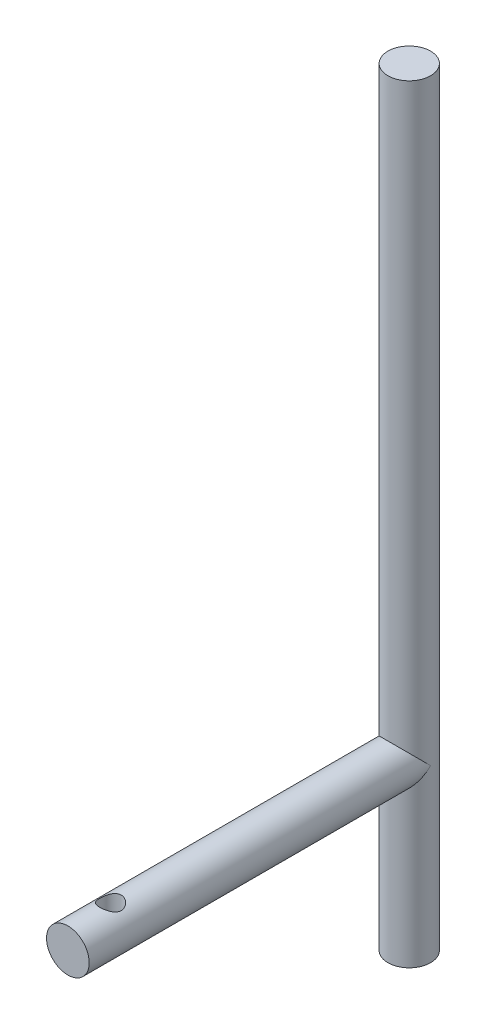
ISO-10303-21;
HEADER;
FILE_DESCRIPTION(('STEP AP214'),'2;1');
FILE_NAME('part.step','',(''),(''),'','','');
FILE_SCHEMA(('AUTOMOTIVE_DESIGN { 1 0 10303 214 1 1 1 1 }'));
ENDSEC;
DATA;
#1=APPLICATION_CONTEXT('core data for automotive mechanical design processes');
#2=APPLICATION_PROTOCOL_DEFINITION('international standard','automotive_design',2000,#1);
#3=PRODUCT_CONTEXT('',#1,'mechanical');
#4=PRODUCT('Part','Part','',(#3));
#5=PRODUCT_RELATED_PRODUCT_CATEGORY('part','',(#4));
#6=PRODUCT_DEFINITION_FORMATION('','',#4);
#7=PRODUCT_DEFINITION_CONTEXT('part definition',#1,'design');
#8=PRODUCT_DEFINITION('design','',#6,#7);
#9=PRODUCT_DEFINITION_SHAPE('','',#8);
#10=(LENGTH_UNIT() NAMED_UNIT(*) SI_UNIT(.MILLI.,.METRE.));
#11=(NAMED_UNIT(*) PLANE_ANGLE_UNIT() SI_UNIT($,.RADIAN.));
#12=(NAMED_UNIT(*) SI_UNIT($,.STERADIAN.) SOLID_ANGLE_UNIT());
#13=UNCERTAINTY_MEASURE_WITH_UNIT(LENGTH_MEASURE(1.E-05),#10,'distance_accuracy_value','');
#14=(GEOMETRIC_REPRESENTATION_CONTEXT(3) GLOBAL_UNCERTAINTY_ASSIGNED_CONTEXT((#13)) GLOBAL_UNIT_ASSIGNED_CONTEXT((#10,
#11,#12)) REPRESENTATION_CONTEXT('',''));
#15=CARTESIAN_POINT('',(0.,0.,0.));
#16=DIRECTION('',(0.,0.,1.));
#17=DIRECTION('',(1.,0.,0.));
#18=AXIS2_PLACEMENT_3D('',#15,#16,#17);
#19=CARTESIAN_POINT('',(0.,25.4,50.8));
#20=DIRECTION('',(0.,0.,-1.));
#21=DIRECTION('',(-1.,0.,0.));
#22=AXIS2_PLACEMENT_3D('',#19,#20,#21);
#23=CYLINDRICAL_SURFACE('',#22,3.175);
#24=CARTESIAN_POINT('',(0.,25.4,50.8));
#25=DIRECTION('',(0.,0.,1.));
#26=DIRECTION('',(1.,0.,0.));
#27=AXIS2_PLACEMENT_3D('',#24,#25,#26);
#28=CIRCLE('',#27,3.175);
#29=CARTESIAN_POINT('',(3.175,25.4,50.8));
#30=VERTEX_POINT('',#29);
#31=EDGE_CURVE('E94',#30,#30,#28,.T.);
#32=ORIENTED_EDGE('',*,*,#31,.F.);
#33=EDGE_LOOP('',(#32));
#34=FACE_BOUND('',#33,.T.);
#35=CARTESIAN_POINT('',(0.,25.4,0.));
#36=DIRECTION('',(0.,-0.707106781186547,0.707106781186547));
#37=DIRECTION('',(0.,-0.707106781186547,-0.707106781186547));
#38=AXIS2_PLACEMENT_3D('',#35,#36,#37);
#39=ELLIPSE('',#38,4.49012806053458,3.175);
#40=CARTESIAN_POINT('',(3.175,25.4,0.));
#41=VERTEX_POINT('',#40);
#42=CARTESIAN_POINT('',(-3.175,25.4,0.));
#43=VERTEX_POINT('',#42);
#44=EDGE_CURVE('E49',#41,#43,#39,.T.);
#45=ORIENTED_EDGE('',*,*,#44,.T.);
#46=CARTESIAN_POINT('',(0.,25.4,0.));
#47=DIRECTION('',(0.,-0.707106781186547,-0.707106781186547));
#48=DIRECTION('',(0.,-0.707106781186547,0.707106781186547));
#49=AXIS2_PLACEMENT_3D('',#46,#47,#48);
#50=ELLIPSE('',#49,4.49012806053458,3.175);
#51=EDGE_CURVE('E11',#43,#41,#50,.F.);
#52=ORIENTED_EDGE('',*,*,#51,.T.);
#53=EDGE_LOOP('',(#45,#52));
#54=FACE_BOUND('',#53,.T.);
#55=CARTESIAN_POINT('',(0.,22.225,42.8625));
#56=CARTESIAN_POINT('',(0.0834579911850827,22.225004549695,42.8625052424285));
#57=CARTESIAN_POINT('',(0.16701547701988,22.2283259550614,42.8691199910797));
#58=CARTESIAN_POINT('',(0.331660873489372,22.2412852729101,42.8952864475422));
#59=CARTESIAN_POINT('',(0.412743787657886,22.2509351807159,42.914862723884));
#60=CARTESIAN_POINT('',(0.569807002497712,22.2755415644714,42.9659951711789));
#61=CARTESIAN_POINT('',(0.645805799665895,22.2904774030566,42.9975047849936));
#62=CARTESIAN_POINT('',(0.791325279180476,22.3242857978123,43.0713683614169));
#63=CARTESIAN_POINT('',(0.860846471709219,22.3431580435678,43.1137214689951));
#64=CARTESIAN_POINT('',(0.996168660697031,22.3844444001533,43.2109836335579));
#65=CARTESIAN_POINT('',(1.06149014765635,22.4070037138503,43.2664972857929));
#66=CARTESIAN_POINT('',(1.18233736872633,22.452647972333,43.3872028483047));
#67=CARTESIAN_POINT('',(1.23785563818199,22.4757333026816,43.4524020646888));
#68=CARTESIAN_POINT('',(1.34183755071482,22.5218791497421,43.5966923173684));
#69=CARTESIAN_POINT('',(1.38942022018822,22.5447989068492,43.6764685561241));
#70=CARTESIAN_POINT('',(1.47029206018898,22.5855850869894,43.8441581458781));
#71=CARTESIAN_POINT('',(1.50359144125905,22.603455116739,43.9320656293474));
#72=CARTESIAN_POINT('',(1.55278525197438,22.6304813607748,44.1081558548573));
#73=CARTESIAN_POINT('',(1.5696022981152,22.6400951886085,44.196007067657));
#74=CARTESIAN_POINT('',(1.58817785187779,22.6507374970671,44.3737664049749));
#75=CARTESIAN_POINT('',(1.58995124029225,22.6517744616753,44.463672408633));
#76=CARTESIAN_POINT('',(1.57906606838602,22.6455139821662,44.6314290636006));
#77=CARTESIAN_POINT('',(1.5681079882647,22.6391983768655,44.7094356495666));
#78=CARTESIAN_POINT('',(1.53501701037788,22.6206648688501,44.8623085311297));
#79=CARTESIAN_POINT('',(1.51288055293752,22.6084450860455,44.9371738181722));
#80=CARTESIAN_POINT('',(1.45765802636278,22.5792113119477,45.083776247948));
#81=CARTESIAN_POINT('',(1.42432891904664,22.562092279459,45.1553999080724));
#82=CARTESIAN_POINT('',(1.34785367917295,22.5249834570327,45.2923819394866));
#83=CARTESIAN_POINT('',(1.30470313705229,22.5049923791145,45.3577374777651));
#84=CARTESIAN_POINT('',(1.20342986217405,22.4613286182853,45.4890524887299));
#85=CARTESIAN_POINT('',(1.14410245266123,22.4375105249917,45.5540377868021));
#86=CARTESIAN_POINT('',(1.01529448125193,22.390931480106,45.6735424770131));
#87=CARTESIAN_POINT('',(0.945809094811679,22.368171037654,45.7280568673538));
#88=CARTESIAN_POINT('',(0.794569953008062,22.3249809518829,45.8274509868847));
#89=CARTESIAN_POINT('',(0.712396326664065,22.3047086264281,45.8717657500076));
#90=CARTESIAN_POINT('',(0.540490117088468,22.2701186372003,45.9455790336058));
#91=CARTESIAN_POINT('',(0.450763602321128,22.2557962467711,45.9750893187116));
#92=CARTESIAN_POINT('',(0.274266805511366,22.2357262018547,46.0160297034002));
#93=CARTESIAN_POINT('',(0.187867179745469,22.2293666044667,46.028754836748));
#94=CARTESIAN_POINT('',(0.0139376149195965,22.2238409113367,46.039825260676));
#95=CARTESIAN_POINT('',(-0.0735917690434795,22.2246714077991,46.0381773634526));
#96=CARTESIAN_POINT('',(-0.240082343027754,22.2330773229767,46.0212968821352));
#97=CARTESIAN_POINT('',(-0.319181810279263,22.2401249747003,46.0071271042911));
#98=CARTESIAN_POINT('',(-0.473720941529331,22.2595730303769,45.9672720608665));
#99=CARTESIAN_POINT('',(-0.549160201034601,22.2719740244412,45.9415855257551));
#100=CARTESIAN_POINT('',(-0.696735665913698,22.3014500088093,45.8787524345376));
#101=CARTESIAN_POINT('',(-0.768715755246714,22.3186485019071,45.8412992079404));
#102=CARTESIAN_POINT('',(-0.905607411697595,22.356064407711,45.7563417871611));
#103=CARTESIAN_POINT('',(-0.970515949770341,22.3762831053749,45.7088333113298));
#104=CARTESIAN_POINT('',(-1.09818120674663,22.4201319862879,45.5997303247875));
#105=CARTESIAN_POINT('',(-1.16010067353771,22.4439022031094,45.5372106963433));
#106=CARTESIAN_POINT('',(-1.27294690977618,22.49070953321,45.4026188223466));
#107=CARTESIAN_POINT('',(-1.3238660748176,22.5137461300242,45.3305400238289));
#108=CARTESIAN_POINT('',(-1.41558631423544,22.557562323722,45.1744656990004));
#109=CARTESIAN_POINT('',(-1.45577797458289,22.5781785927737,45.090062115075));
#110=CARTESIAN_POINT('',(-1.52095648617134,22.6127616023306,44.9143277677247));
#111=CARTESIAN_POINT('',(-1.54596292893889,22.6267369057297,44.8230061017338));
#112=CARTESIAN_POINT('',(-1.57775542885366,22.6447111712154,44.6454050211705));
#113=CARTESIAN_POINT('',(-1.58606013179365,22.6495390374921,44.5594831226716));
#114=CARTESIAN_POINT('',(-1.58859403257222,22.6509999950645,44.3873777808763));
#115=CARTESIAN_POINT('',(-1.5828293315144,22.6476366384311,44.3011944671286));
#116=CARTESIAN_POINT('',(-1.55880772437938,22.6339739399392,44.1396699413157));
#117=CARTESIAN_POINT('',(-1.54179319901956,22.6243658750878,44.0640780036452));
#118=CARTESIAN_POINT('',(-1.49729088118125,22.600110118021,43.9169046104138));
#119=CARTESIAN_POINT('',(-1.46979971971637,22.5854608048315,43.8453244534289));
#120=CARTESIAN_POINT('',(-1.40305749566465,22.551572080463,43.7028830490589));
#121=CARTESIAN_POINT('',(-1.36314043128243,22.5320904069648,43.6323932058464));
#122=CARTESIAN_POINT('',(-1.27341466747436,22.4911391102966,43.4986516738122));
#123=CARTESIAN_POINT('',(-1.22360082184598,22.4696684559947,43.4354037777977));
#124=CARTESIAN_POINT('',(-1.10839778107493,22.4240356198653,43.309949603012));
#125=CARTESIAN_POINT('',(-1.04185152150815,22.3998633900073,43.2488036750189));
#126=CARTESIAN_POINT('',(-0.898770754895193,22.3539406828736,43.1383075137965));
#127=CARTESIAN_POINT('',(-0.822230898246993,22.3321915143091,43.0889636385915));
#128=CARTESIAN_POINT('',(-0.660291409892919,22.2932940981312,43.0034122741946));
#129=CARTESIAN_POINT('',(-0.574832962245553,22.2761794681588,42.9673001313371));
#130=CARTESIAN_POINT('',(-0.398053085556709,22.2487912068786,42.9104295336851));
#131=CARTESIAN_POINT('',(-0.306749131847694,22.2384981416113,42.8896274431959));
#132=CARTESIAN_POINT('',(-0.178755590054295,22.2298345421235,42.8721878599014));
#133=CARTESIAN_POINT('',(-0.143131983613484,22.2280263252235,42.8685600576247));
#134=CARTESIAN_POINT('',(-0.0716783742405825,22.225608060493,42.8637149684964));
#135=CARTESIAN_POINT('',(-0.0358483656390225,22.2249980457338,42.8624977481785));
#136=CARTESIAN_POINT('',(0.,22.225,42.8625));
#137=B_SPLINE_CURVE_WITH_KNOTS('',3,(#55,#56,#57,#58,#59,#60,#61,#62,#63,#64,#65,#66,#67,#68,
#69,#70,#71,#72,#73,#74,#75,#76,#77,#78,#79,#80,#81,#82,#83,#84,#85,#86,#87,#88,#89,#90,#91,#92,
#93,#94,#95,#96,#97,#98,#99,#100,#101,#102,#103,#104,#105,#106,#107,#108,#109,#110,#111,#112,
#113,#114,#115,#116,#117,#118,#119,#120,#121,#122,#123,#124,#125,#126,#127,#128,#129,#130,#131,
#132,#133,#134,#135,#136),.UNSPECIFIED.,.T.,.F.,(4,2,2,2,2,2,2,2,2,2,2,2,2,2,2,2,2,2,2,2,2,2,2,
2,2,2,2,2,2,2,2,2,2,2,2,2,2,2,2,2,4),(0.,0.250228508654714,0.500932687663352,0.750668671844023,
1.00038496992324,1.26520854196497,1.53023290227578,1.8158099070882,2.10118242288521,
2.36947094272614,2.63749404759819,2.87346568449795,3.10951251232014,3.35105756267473,
3.59271127500602,3.86500594367532,4.13743036175414,4.42250547765424,4.70735369348243,
4.96860973623261,5.22974196161968,5.47063464078468,5.71155388089103,5.95936158944289,
6.20727503062988,6.47953381898015,6.75198021926997,7.03762057931739,7.32289162713402,
7.58077775661086,7.83855207535177,8.07176964270058,8.30506226951506,8.55402875138705,
8.80312503315513,9.08248822877009,9.36200158617727,9.64349121690848,9.92417542436073,
10.0316550721259,10.1391376863632),.UNSPECIFIED.);
#138=CARTESIAN_POINT('',(0.,22.225,42.8625));
#139=VERTEX_POINT('',#138);
#140=EDGE_CURVE('E64',#139,#139,#137,.T.);
#141=ORIENTED_EDGE('',*,*,#140,.F.);
#142=EDGE_LOOP('',(#141));
#143=FACE_BOUND('',#142,.T.);
#144=CARTESIAN_POINT('',(0.,28.575,42.8625));
#145=CARTESIAN_POINT('',(-0.0834579911850834,28.574995450305,42.8625052424285));
#146=CARTESIAN_POINT('',(-0.167015477019881,28.5716740449386,42.8691199910797));
#147=CARTESIAN_POINT('',(-0.331660873489373,28.5587147270899,42.8952864475422));
#148=CARTESIAN_POINT('',(-0.412743787657887,28.5490648192841,42.914862723884));
#149=CARTESIAN_POINT('',(-0.569807002497713,28.5244584355286,42.9659951711789));
#150=CARTESIAN_POINT('',(-0.645805799665896,28.5095225969434,42.9975047849936));
#151=CARTESIAN_POINT('',(-0.791325279180477,28.4757142021877,43.0713683614169));
#152=CARTESIAN_POINT('',(-0.860846471709221,28.4568419564322,43.1137214689951));
#153=CARTESIAN_POINT('',(-0.996168660697033,28.4155555998467,43.2109836335579));
#154=CARTESIAN_POINT('',(-1.06149014765635,28.3929962861497,43.2664972857929));
#155=CARTESIAN_POINT('',(-1.18233736872633,28.347352027667,43.3872028483047));
#156=CARTESIAN_POINT('',(-1.23785563818199,28.3242666973184,43.4524020646888));
#157=CARTESIAN_POINT('',(-1.34183755071482,28.2781208502579,43.5966923173684));
#158=CARTESIAN_POINT('',(-1.38942022018822,28.2552010931508,43.6764685561241));
#159=CARTESIAN_POINT('',(-1.47029206018898,28.2144149130106,43.8441581458781));
#160=CARTESIAN_POINT('',(-1.50359144125905,28.196544883261,43.9320656293474));
#161=CARTESIAN_POINT('',(-1.55278525197438,28.1695186392252,44.1081558548573));
#162=CARTESIAN_POINT('',(-1.5696022981152,28.1599048113914,44.196007067657));
#163=CARTESIAN_POINT('',(-1.58817785187779,28.1492625029329,44.3737664049749));
#164=CARTESIAN_POINT('',(-1.58995124029225,28.1482255383247,44.463672408633));
#165=CARTESIAN_POINT('',(-1.57906606838602,28.1544860178338,44.6314290636006));
#166=CARTESIAN_POINT('',(-1.5681079882647,28.1608016231345,44.7094356495666));
#167=CARTESIAN_POINT('',(-1.53501701037788,28.1793351311499,44.8623085311297));
#168=CARTESIAN_POINT('',(-1.51288055293752,28.1915549139545,44.9371738181722));
#169=CARTESIAN_POINT('',(-1.45765802636278,28.2207886880523,45.083776247948));
#170=CARTESIAN_POINT('',(-1.42432891904664,28.237907720541,45.1553999080724));
#171=CARTESIAN_POINT('',(-1.34785367917295,28.2750165429673,45.2923819394866));
#172=CARTESIAN_POINT('',(-1.30470313705229,28.2950076208855,45.3577374777651));
#173=CARTESIAN_POINT('',(-1.20342986217405,28.3386713817147,45.4890524887299));
#174=CARTESIAN_POINT('',(-1.14410245266123,28.3624894750083,45.5540377868021));
#175=CARTESIAN_POINT('',(-1.01529448125193,28.409068519894,45.6735424770131));
#176=CARTESIAN_POINT('',(-0.945809094811675,28.431828962346,45.7280568673538));
#177=CARTESIAN_POINT('',(-0.794569953008055,28.4750190481171,45.8274509868847));
#178=CARTESIAN_POINT('',(-0.712396326664057,28.4952913735719,45.8717657500076));
#179=CARTESIAN_POINT('',(-0.540490117088461,28.5298813627997,45.9455790336058));
#180=CARTESIAN_POINT('',(-0.450763602321122,28.5442037532289,45.9750893187116));
#181=CARTESIAN_POINT('',(-0.274266805511362,28.5642737981453,46.0160297034002));
#182=CARTESIAN_POINT('',(-0.187867179745465,28.5706333955333,46.028754836748));
#183=CARTESIAN_POINT('',(-0.0139376149195934,28.5761590886633,46.039825260676));
#184=CARTESIAN_POINT('',(0.073591769043482,28.5753285922009,46.0381773634526));
#185=CARTESIAN_POINT('',(0.240082343027756,28.5669226770233,46.0212968821352));
#186=CARTESIAN_POINT('',(0.319181810279266,28.5598750252997,46.0071271042911));
#187=CARTESIAN_POINT('',(0.473720941529333,28.5404269696231,45.9672720608665));
#188=CARTESIAN_POINT('',(0.549160201034602,28.5280259755588,45.9415855257551));
#189=CARTESIAN_POINT('',(0.696735665913698,28.4985499911907,45.8787524345376));
#190=CARTESIAN_POINT('',(0.768715755246713,28.4813514980929,45.8412992079404));
#191=CARTESIAN_POINT('',(0.905607411697593,28.443935592289,45.7563417871611));
#192=CARTESIAN_POINT('',(0.97051594977034,28.4237168946251,45.7088333113298));
#193=CARTESIAN_POINT('',(1.09818120674663,28.3798680137121,45.5997303247875));
#194=CARTESIAN_POINT('',(1.16010067353771,28.3560977968906,45.5372106963433));
#195=CARTESIAN_POINT('',(1.27294690977618,28.30929046679,45.4026188223466));
#196=CARTESIAN_POINT('',(1.3238660748176,28.2862538699757,45.3305400238289));
#197=CARTESIAN_POINT('',(1.41558631423544,28.242437676278,45.1744656990004));
#198=CARTESIAN_POINT('',(1.45577797458289,28.2218214072263,45.090062115075));
#199=CARTESIAN_POINT('',(1.52095648617134,28.1872383976694,44.9143277677247));
#200=CARTESIAN_POINT('',(1.54596292893889,28.1732630942703,44.8230061017338));
#201=CARTESIAN_POINT('',(1.57775542885366,28.1552888287846,44.6454050211705));
#202=CARTESIAN_POINT('',(1.58606013179365,28.1504609625079,44.5594831226716));
#203=CARTESIAN_POINT('',(1.58859403257222,28.1490000049355,44.3873777808763));
#204=CARTESIAN_POINT('',(1.5828293315144,28.1523633615689,44.3011944671286));
#205=CARTESIAN_POINT('',(1.55880772437938,28.1660260600608,44.1396699413157));
#206=CARTESIAN_POINT('',(1.54179319901956,28.1756341249122,44.0640780036452));
#207=CARTESIAN_POINT('',(1.49729088118125,28.199889881979,43.9169046104138));
#208=CARTESIAN_POINT('',(1.46979971971637,28.2145391951685,43.8453244534289));
#209=CARTESIAN_POINT('',(1.40305749566465,28.248427919537,43.7028830490589));
#210=CARTESIAN_POINT('',(1.36314043128243,28.2679095930352,43.6323932058464));
#211=CARTESIAN_POINT('',(1.27341466747436,28.3088608897034,43.4986516738122));
#212=CARTESIAN_POINT('',(1.22360082184598,28.3303315440053,43.4354037777977));
#213=CARTESIAN_POINT('',(1.10839778107493,28.3759643801347,43.309949603012));
#214=CARTESIAN_POINT('',(1.04185152150815,28.4001366099927,43.2488036750189));
#215=CARTESIAN_POINT('',(0.898770754895193,28.4460593171264,43.1383075137965));
#216=CARTESIAN_POINT('',(0.822230898246992,28.4678084856908,43.0889636385915));
#217=CARTESIAN_POINT('',(0.660291409892918,28.5067059018688,43.0034122741946));
#218=CARTESIAN_POINT('',(0.574832962245552,28.5238205318412,42.9673001313371));
#219=CARTESIAN_POINT('',(0.398053085556706,28.5512087931214,42.9104295336851));
#220=CARTESIAN_POINT('',(0.30674913184769,28.5615018583887,42.8896274431959));
#221=CARTESIAN_POINT('',(0.178755590054292,28.5701654578765,42.8721878599014));
#222=CARTESIAN_POINT('',(0.143131983613481,28.5719736747765,42.8685600576247));
#223=CARTESIAN_POINT('',(0.071678374240581,28.5743919395069,42.8637149684964));
#224=CARTESIAN_POINT('',(0.0358483656390217,28.5750019542662,42.8624977481785));
#225=CARTESIAN_POINT('',(0.,28.575,42.8625));
#226=B_SPLINE_CURVE_WITH_KNOTS('',3,(#144,#145,#146,#147,#148,#149,#150,#151,#152,#153,#154,
#155,#156,#157,#158,#159,#160,#161,#162,#163,#164,#165,#166,#167,#168,#169,#170,#171,#172,#173,
#174,#175,#176,#177,#178,#179,#180,#181,#182,#183,#184,#185,#186,#187,#188,#189,#190,#191,#192,
#193,#194,#195,#196,#197,#198,#199,#200,#201,#202,#203,#204,#205,#206,#207,#208,#209,#210,#211,
#212,#213,#214,#215,#216,#217,#218,#219,#220,#221,#222,#223,#224,#225),.UNSPECIFIED.,.T.,.F.,(4,
2,2,2,2,2,2,2,2,2,2,2,2,2,2,2,2,2,2,2,2,2,2,2,2,2,2,2,2,2,2,2,2,2,2,2,2,2,2,2,4),(0.,
0.250228508654715,0.500932687663352,0.750668671844024,1.00038496992324,1.26520854196497,
1.53023290227578,1.8158099070882,2.10118242288521,2.36947094272615,2.63749404759819,
2.87346568449797,3.10951251232015,3.35105756267473,3.59271127500602,3.86500594367532,
4.13743036175415,4.42250547765424,4.70735369348243,4.96860973623261,5.22974196161968,
5.47063464078468,5.71155388089103,5.95936158944288,6.20727503062988,6.47953381898014,
6.75198021926997,7.03762057931738,7.32289162713402,7.58077775661085,7.83855207535176,
8.07176964270058,8.30506226951506,8.55402875138704,8.80312503315513,9.08248822877009,
9.36200158617727,9.64349121690848,9.92417542436073,10.0316550721259,10.1391376863632),.UNSPECIFIED.);
#227=CARTESIAN_POINT('',(0.,28.575,42.8625));
#228=VERTEX_POINT('',#227);
#229=EDGE_CURVE('E39',#228,#228,#226,.T.);
#230=ORIENTED_EDGE('',*,*,#229,.F.);
#231=EDGE_LOOP('',(#230));
#232=FACE_BOUND('',#231,.T.);
#233=ADVANCED_FACE('F35',(#34,#54,#143,#232),#23,.T.);
#234=CARTESIAN_POINT('',(0.,114.3,0.));
#235=DIRECTION('',(0.,-1.,0.));
#236=DIRECTION('',(0.,0.,-1.));
#237=AXIS2_PLACEMENT_3D('',#234,#235,#236);
#238=CYLINDRICAL_SURFACE('',#237,3.175);
#239=CARTESIAN_POINT('',(0.,0.,0.));
#240=DIRECTION('',(0.,1.,0.));
#241=DIRECTION('',(0.,0.,1.));
#242=AXIS2_PLACEMENT_3D('',#239,#240,#241);
#243=CIRCLE('',#242,3.175);
#244=CARTESIAN_POINT('',(0.,0.,3.175));
#245=VERTEX_POINT('',#244);
#246=EDGE_CURVE('E61',#245,#245,#243,.T.);
#247=ORIENTED_EDGE('',*,*,#246,.T.);
#248=EDGE_LOOP('',(#247));
#249=FACE_BOUND('',#248,.T.);
#250=CARTESIAN_POINT('',(0.,114.3,0.));
#251=DIRECTION('',(0.,1.,0.));
#252=DIRECTION('',(0.,0.,1.));
#253=AXIS2_PLACEMENT_3D('',#250,#251,#252);
#254=CIRCLE('',#253,3.175);
#255=CARTESIAN_POINT('',(0.,114.3,3.175));
#256=VERTEX_POINT('',#255);
#257=EDGE_CURVE('E58',#256,#256,#254,.T.);
#258=ORIENTED_EDGE('',*,*,#257,.F.);
#259=EDGE_LOOP('',(#258));
#260=FACE_BOUND('',#259,.T.);
#261=ORIENTED_EDGE('',*,*,#51,.F.);
#262=ORIENTED_EDGE('',*,*,#44,.F.);
#263=EDGE_LOOP('',(#261,#262));
#264=FACE_BOUND('',#263,.T.);
#265=ADVANCED_FACE('F37',(#249,#260,#264),#238,.T.);
#266=CARTESIAN_POINT('',(0.,114.3,0.));
#267=DIRECTION('',(0.,1.,0.));
#268=DIRECTION('',(0.,0.,1.));
#269=AXIS2_PLACEMENT_3D('',#266,#267,#268);
#270=PLANE('',#269);
#271=ORIENTED_EDGE('',*,*,#257,.T.);
#272=EDGE_LOOP('',(#271));
#273=FACE_BOUND('',#272,.T.);
#274=ADVANCED_FACE('F84',(#273),#270,.T.);
#275=CARTESIAN_POINT('',(0.,0.,0.));
#276=DIRECTION('',(0.,1.,0.));
#277=DIRECTION('',(0.,0.,1.));
#278=AXIS2_PLACEMENT_3D('',#275,#276,#277);
#279=PLANE('',#278);
#280=ORIENTED_EDGE('',*,*,#246,.F.);
#281=EDGE_LOOP('',(#280));
#282=FACE_BOUND('',#281,.T.);
#283=ADVANCED_FACE('F79',(#282),#279,.F.);
#284=CARTESIAN_POINT('',(0.,25.4,50.8));
#285=DIRECTION('',(0.,0.,1.));
#286=DIRECTION('',(1.,0.,0.));
#287=AXIS2_PLACEMENT_3D('',#284,#285,#286);
#288=PLANE('',#287);
#289=ORIENTED_EDGE('',*,*,#31,.T.);
#290=EDGE_LOOP('',(#289));
#291=FACE_BOUND('',#290,.T.);
#292=ADVANCED_FACE('F75',(#291),#288,.T.);
#293=CARTESIAN_POINT('',(0.,114.3,44.45));
#294=DIRECTION('',(0.,-1.,0.));
#295=DIRECTION('',(0.,0.,-1.));
#296=AXIS2_PLACEMENT_3D('',#293,#294,#295);
#297=CYLINDRICAL_SURFACE('',#296,1.5875);
#298=ORIENTED_EDGE('',*,*,#140,.T.);
#299=EDGE_LOOP('',(#298));
#300=FACE_BOUND('',#299,.T.);
#301=ORIENTED_EDGE('',*,*,#229,.T.);
#302=EDGE_LOOP('',(#301));
#303=FACE_BOUND('',#302,.T.);
#304=ADVANCED_FACE('F72',(#300,#303),#297,.F.);
#305=CLOSED_SHELL('',(#233,#265,#274,#283,#292,#304));
#306=MANIFOLD_SOLID_BREP('B2',#305);
#307=ADVANCED_BREP_SHAPE_REPRESENTATION('',(#18,#306),#14);
#308=SHAPE_DEFINITION_REPRESENTATION(#9,#307);
ENDSEC;
END-ISO-10303-21;
